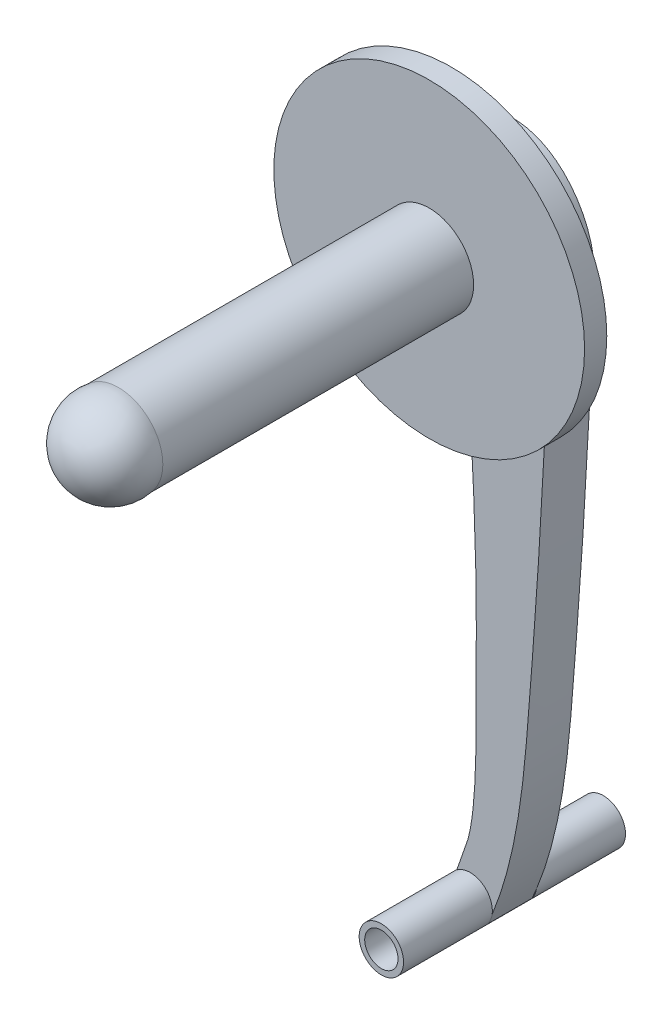
ISO-10303-21;
HEADER;
FILE_DESCRIPTION(('STEP AP214'),'2;1');
FILE_NAME('part.step','',(''),(''),'','','');
FILE_SCHEMA(('AUTOMOTIVE_DESIGN { 1 0 10303 214 1 1 1 1 }'));
ENDSEC;
DATA;
#1=APPLICATION_CONTEXT('core data for automotive mechanical design processes');
#2=APPLICATION_PROTOCOL_DEFINITION('international standard','automotive_design',2000,#1);
#3=PRODUCT_CONTEXT('',#1,'mechanical');
#4=PRODUCT('Part','Part','',(#3));
#5=PRODUCT_RELATED_PRODUCT_CATEGORY('part','',(#4));
#6=PRODUCT_DEFINITION_FORMATION('','',#4);
#7=PRODUCT_DEFINITION_CONTEXT('part definition',#1,'design');
#8=PRODUCT_DEFINITION('design','',#6,#7);
#9=PRODUCT_DEFINITION_SHAPE('','',#8);
#10=(LENGTH_UNIT() NAMED_UNIT(*) SI_UNIT(.MILLI.,.METRE.));
#11=(NAMED_UNIT(*) PLANE_ANGLE_UNIT() SI_UNIT($,.RADIAN.));
#12=(NAMED_UNIT(*) SI_UNIT($,.STERADIAN.) SOLID_ANGLE_UNIT());
#13=UNCERTAINTY_MEASURE_WITH_UNIT(LENGTH_MEASURE(1.E-05),#10,'distance_accuracy_value','');
#14=(GEOMETRIC_REPRESENTATION_CONTEXT(3) GLOBAL_UNCERTAINTY_ASSIGNED_CONTEXT((#13)) GLOBAL_UNIT_ASSIGNED_CONTEXT((#10,
#11,#12)) REPRESENTATION_CONTEXT('',''));
#15=CARTESIAN_POINT('',(0.,0.,0.));
#16=DIRECTION('',(0.,0.,1.));
#17=DIRECTION('',(1.,0.,0.));
#18=AXIS2_PLACEMENT_3D('',#15,#16,#17);
#19=CARTESIAN_POINT('',(2.50663228078687,-1.94869690021748,6.35));
#20=CARTESIAN_POINT('',(6.79184757589289,7.644498001818,6.35));
#21=CARTESIAN_POINT('',(8.23865016719321,25.0555824378428,6.35));
#22=CARTESIAN_POINT('',(10.0949531136006,49.9828909575026,6.35));
#23=CARTESIAN_POINT('',(10.9118015719883,68.4915232685859,6.35));
#24=CARTESIAN_POINT('',(12.4139862903191,85.5621100820569,6.35));
#25=CARTESIAN_POINT('',(5.09918481046593,93.2068392614241,6.35));
#26=CARTESIAN_POINT('',(0.,93.3171933343756,6.35));
#27=B_SPLINE_CURVE_WITH_KNOTS('',3,(#19,#20,#21,#22,#23,#24,#25,#26),.UNSPECIFIED.,.F.,.F.,(4,1,
1,1,1,4),(0.,0.304932513484829,0.511760329482619,0.735953186253162,0.858254476220864,1.),.UNSPECIFIED.);
#28=DIRECTION('',(0.,0.,-1.));
#29=VECTOR('',#28,1.);
#30=SURFACE_OF_LINEAR_EXTRUSION('',#27,#29);
#31=CARTESIAN_POINT('',(2.50663228078687,-1.94869690021748,0.));
#32=CARTESIAN_POINT('',(6.79184757589289,7.644498001818,0.));
#33=CARTESIAN_POINT('',(8.23865016719321,25.0555824378428,0.));
#34=CARTESIAN_POINT('',(10.0949531136006,49.9828909575026,0.));
#35=CARTESIAN_POINT('',(10.9118015719883,68.4915232685859,0.));
#36=CARTESIAN_POINT('',(12.4139862903191,85.5621100820569,0.));
#37=CARTESIAN_POINT('',(5.09918481046593,93.2068392614241,0.));
#38=CARTESIAN_POINT('',(0.,93.3171933343756,0.));
#39=B_SPLINE_CURVE_WITH_KNOTS('',3,(#31,#32,#33,#34,#35,#36,#37,#38),.UNSPECIFIED.,.F.,.F.,(4,1,
1,1,1,4),(0.,0.304932513484829,0.511760329482619,0.735953186253162,0.858254476220864,1.),.UNSPECIFIED.);
#40=CARTESIAN_POINT('',(2.50663228078687,-1.94869690021748,0.));
#41=VERTEX_POINT('',#40);
#42=CARTESIAN_POINT('',(3.14116205546175,-0.462305030609967,0.));
#43=VERTEX_POINT('',#42);
#44=EDGE_CURVE('E113',#41,#43,#39,.T.);
#45=ORIENTED_EDGE('',*,*,#44,.T.);
#46=CARTESIAN_POINT('',(0.,93.3171933343756,0.));
#47=VERTEX_POINT('',#46);
#48=EDGE_CURVE('E120',#43,#47,#39,.T.);
#49=ORIENTED_EDGE('',*,*,#48,.T.);
#50=DIRECTION('',(0.,0.,-1.));
#51=VECTOR('',#50,1.);
#52=CARTESIAN_POINT('',(0.,93.3171933343756,6.35));
#53=LINE('',#52,#51);
#54=CARTESIAN_POINT('',(0.,93.3171933343756,6.35));
#55=VERTEX_POINT('',#54);
#56=EDGE_CURVE('E157',#55,#47,#53,.T.);
#57=ORIENTED_EDGE('',*,*,#56,.F.);
#58=CARTESIAN_POINT('',(3.14116205546175,-0.462305030609967,6.35));
#59=VERTEX_POINT('',#58);
#60=EDGE_CURVE('E100',#59,#55,#27,.T.);
#61=ORIENTED_EDGE('',*,*,#60,.F.);
#62=CARTESIAN_POINT('',(2.50663228078687,-1.94869690021748,6.35));
#63=VERTEX_POINT('',#62);
#64=EDGE_CURVE('E130',#63,#59,#27,.T.);
#65=ORIENTED_EDGE('',*,*,#64,.F.);
#66=DIRECTION('',(0.,0.,-1.));
#67=VECTOR('',#66,1.);
#68=CARTESIAN_POINT('',(2.50663228078687,-1.94869690021748,6.35));
#69=LINE('',#68,#67);
#70=EDGE_CURVE('E125',#63,#41,#69,.T.);
#71=ORIENTED_EDGE('',*,*,#70,.T.);
#72=EDGE_LOOP('',(#45,#49,#57,#61,#65,#71));
#73=FACE_BOUND('',#72,.T.);
#74=ADVANCED_FACE('F43',(#73),#30,.F.);
#75=CARTESIAN_POINT('',(0.,67.6387741491842,6.35));
#76=DIRECTION('',(0.,0.,-1.));
#77=DIRECTION('',(-1.,0.,0.));
#78=AXIS2_PLACEMENT_3D('',#75,#76,#77);
#79=CYLINDRICAL_SURFACE('',#78,25.6784191851915);
#80=CARTESIAN_POINT('',(0.,67.6387741491842,0.));
#81=DIRECTION('',(0.,0.,1.));
#82=DIRECTION('',(1.,0.,0.));
#83=AXIS2_PLACEMENT_3D('',#80,#81,#82);
#84=CIRCLE('',#83,25.6784191851915);
#85=CARTESIAN_POINT('',(-22.4234054714317,80.1516514727327,0.));
#86=VERTEX_POINT('',#85);
#87=EDGE_CURVE('E119',#47,#86,#84,.T.);
#88=ORIENTED_EDGE('',*,*,#87,.T.);
#89=DIRECTION('',(0.,0.,-1.));
#90=VECTOR('',#89,1.);
#91=CARTESIAN_POINT('',(-22.4234054714317,80.1516514727327,6.35));
#92=LINE('',#91,#90);
#93=CARTESIAN_POINT('',(-22.4234054714317,80.1516514727327,6.35));
#94=VERTEX_POINT('',#93);
#95=EDGE_CURVE('E153',#94,#86,#92,.T.);
#96=ORIENTED_EDGE('',*,*,#95,.F.);
#97=CARTESIAN_POINT('',(0.,67.6387741491842,6.35));
#98=DIRECTION('',(0.,0.,1.));
#99=DIRECTION('',(1.,0.,0.));
#100=AXIS2_PLACEMENT_3D('',#97,#98,#99);
#101=CIRCLE('',#100,25.6784191851915);
#102=EDGE_CURVE('E200',#55,#94,#101,.T.);
#103=ORIENTED_EDGE('',*,*,#102,.F.);
#104=ORIENTED_EDGE('',*,*,#56,.T.);
#105=EDGE_LOOP('',(#88,#96,#103,#104));
#106=FACE_BOUND('',#105,.T.);
#107=ADVANCED_FACE('F207',(#106),#79,.T.);
#108=CARTESIAN_POINT('',(-22.4234054714317,80.1516514727327,6.35));
#109=CARTESIAN_POINT('',(-23.0981715014795,78.484949301357,6.35));
#110=CARTESIAN_POINT('',(-21.7101793125884,73.65777514507,6.35));
#111=CARTESIAN_POINT('',(-19.9826645961422,68.7677598488237,6.35));
#112=CARTESIAN_POINT('',(-12.4534255522816,67.1676819119479,6.35));
#113=CARTESIAN_POINT('',(-8.24432583255758,69.3091880074768,6.35));
#114=CARTESIAN_POINT('',(0.0453668571663636,67.6804945172135,6.35));
#115=CARTESIAN_POINT('',(0.404487115203886,52.7492147236427,6.35));
#116=CARTESIAN_POINT('',(0.963776807123551,37.5961578318882,6.35));
#117=CARTESIAN_POINT('',(0.846768385086464,32.3426121330134,6.35));
#118=CARTESIAN_POINT('',(0.858192703651346,19.9211649353462,6.35));
#119=CARTESIAN_POINT('',(0.823670064032925,12.7445285726355,6.35));
#120=CARTESIAN_POINT('',(0.,8.48889990840902,6.35));
#121=B_SPLINE_CURVE_WITH_KNOTS('',3,(#108,#109,#110,#111,#112,#113,#114,#115,#116,#117,#118,
#119,#120),.UNSPECIFIED.,.F.,.F.,(4,1,1,1,1,1,1,1,1,1,4),(0.,0.058727347612114,
0.134625817014667,0.156810161749012,0.266819613488172,0.304169718747484,0.492961109082828,
0.537826004856001,0.707953780706044,0.747032644650169,0.907348672315999),.UNSPECIFIED.);
#122=DIRECTION('',(0.,0.,-1.));
#123=VECTOR('',#122,1.);
#124=SURFACE_OF_LINEAR_EXTRUSION('',#121,#123);
#125=CARTESIAN_POINT('',(-22.4234054714317,80.1516514727327,0.));
#126=CARTESIAN_POINT('',(-23.0981715014795,78.484949301357,0.));
#127=CARTESIAN_POINT('',(-21.7101793125884,73.65777514507,0.));
#128=CARTESIAN_POINT('',(-19.9826645961422,68.7677598488237,0.));
#129=CARTESIAN_POINT('',(-12.4534255522816,67.1676819119479,0.));
#130=CARTESIAN_POINT('',(-8.24432583255758,69.3091880074768,0.));
#131=CARTESIAN_POINT('',(0.0453668571663636,67.6804945172135,0.));
#132=CARTESIAN_POINT('',(0.404487115203886,52.7492147236427,0.));
#133=CARTESIAN_POINT('',(0.963776807123551,37.5961578318882,0.));
#134=CARTESIAN_POINT('',(0.846768385086464,32.3426121330134,0.));
#135=CARTESIAN_POINT('',(0.858192703651346,19.9211649353462,0.));
#136=CARTESIAN_POINT('',(0.823670064032925,12.7445285726355,0.));
#137=CARTESIAN_POINT('',(0.,8.48889990840902,0.));
#138=B_SPLINE_CURVE_WITH_KNOTS('',3,(#125,#126,#127,#128,#129,#130,#131,#132,#133,#134,#135,
#136,#137),.UNSPECIFIED.,.F.,.F.,(4,1,1,1,1,1,1,1,1,1,4),(0.,0.058727347612114,
0.134625817014667,0.156810161749012,0.266819613488172,0.304169718747484,0.492961109082828,
0.537826004856001,0.707953780706044,0.747032644650169,0.907348672315999),.UNSPECIFIED.);
#139=CARTESIAN_POINT('',(0.,8.48889990840902,0.));
#140=VERTEX_POINT('',#139);
#141=EDGE_CURVE('E468',#86,#140,#138,.T.);
#142=ORIENTED_EDGE('',*,*,#141,.T.);
#143=DIRECTION('',(0.,0.,-1.));
#144=VECTOR('',#143,1.);
#145=CARTESIAN_POINT('',(0.,8.48889990840902,6.35));
#146=LINE('',#145,#144);
#147=CARTESIAN_POINT('',(0.,8.48889990840902,6.35));
#148=VERTEX_POINT('',#147);
#149=EDGE_CURVE('E149',#148,#140,#146,.T.);
#150=ORIENTED_EDGE('',*,*,#149,.F.);
#151=EDGE_CURVE('E217',#94,#148,#121,.T.);
#152=ORIENTED_EDGE('',*,*,#151,.F.);
#153=ORIENTED_EDGE('',*,*,#95,.T.);
#154=EDGE_LOOP('',(#142,#150,#152,#153));
#155=FACE_BOUND('',#154,.T.);
#156=ADVANCED_FACE('F210',(#155),#124,.F.);
#157=CARTESIAN_POINT('',(-0.310063399281582,7.13327902007752,6.35));
#158=DIRECTION('',(0.974826131268273,-0.222966396115047,0.));
#159=DIRECTION('',(0.222966396115047,0.974826131268273,0.));
#160=AXIS2_PLACEMENT_3D('',#157,#158,#159);
#161=PLANE('',#160);
#162=DIRECTION('',(-0.222966396115047,-0.974826131268273,0.));
#163=VECTOR('',#162,1.);
#164=CARTESIAN_POINT('',(-0.310063399281582,7.13327902007752,0.));
#165=LINE('',#164,#163);
#166=CARTESIAN_POINT('',(-0.310063399281582,7.13327902007752,0.));
#167=VERTEX_POINT('',#166);
#168=EDGE_CURVE('E463',#140,#167,#165,.T.);
#169=ORIENTED_EDGE('',*,*,#168,.T.);
#170=DIRECTION('',(0.,0.,-1.));
#171=VECTOR('',#170,1.);
#172=CARTESIAN_POINT('',(-0.310063399281582,7.13327902007752,6.35));
#173=LINE('',#172,#171);
#174=CARTESIAN_POINT('',(-0.310063399281582,7.13327902007752,6.35));
#175=VERTEX_POINT('',#174);
#176=EDGE_CURVE('E137',#175,#167,#173,.T.);
#177=ORIENTED_EDGE('',*,*,#176,.F.);
#178=DIRECTION('',(-0.222966396115047,-0.974826131268273,0.));
#179=VECTOR('',#178,1.);
#180=CARTESIAN_POINT('',(-0.310063399281582,7.13327902007752,6.35));
#181=LINE('',#180,#179);
#182=EDGE_CURVE('E70',#148,#175,#181,.T.);
#183=ORIENTED_EDGE('',*,*,#182,.F.);
#184=ORIENTED_EDGE('',*,*,#149,.T.);
#185=EDGE_LOOP('',(#169,#177,#183,#184));
#186=FACE_BOUND('',#185,.T.);
#187=ADVANCED_FACE('F214',(#186),#161,.F.);
#188=CARTESIAN_POINT('',(-0.310063399281582,7.13327902007752,6.35));
#189=CARTESIAN_POINT('',(-1.08234617634393,4.82440788946696,6.35));
#190=CARTESIAN_POINT('',(-1.91151294262382,2.53510222085454,6.35));
#191=B_SPLINE_CURVE_WITH_KNOTS('',2,(#188,#189,#190),.UNSPECIFIED.,.F.,.F.,(3,3),(0.,1.),.UNSPECIFIED.);
#192=DIRECTION('',(0.,0.,-1.));
#193=VECTOR('',#192,1.);
#194=SURFACE_OF_LINEAR_EXTRUSION('',#191,#193);
#195=CARTESIAN_POINT('',(-0.310063399281582,7.13327902007752,0.));
#196=CARTESIAN_POINT('',(-1.08234617634393,4.82440788946696,0.));
#197=CARTESIAN_POINT('',(-1.91151294262382,2.53510222085454,0.));
#198=B_SPLINE_CURVE_WITH_KNOTS('',2,(#195,#196,#197),.UNSPECIFIED.,.F.,.F.,(3,3),(0.,1.),.UNSPECIFIED.);
#199=CARTESIAN_POINT('',(-1.91151294262382,2.53510222085454,0.));
#200=VERTEX_POINT('',#199);
#201=EDGE_CURVE('E141',#167,#200,#198,.T.);
#202=ORIENTED_EDGE('',*,*,#201,.T.);
#203=DIRECTION('',(0.,0.,-1.));
#204=VECTOR('',#203,1.);
#205=CARTESIAN_POINT('',(-1.91151294262382,2.53510222085454,6.35));
#206=LINE('',#205,#204);
#207=CARTESIAN_POINT('',(-1.91151294262382,2.53510222085454,6.35));
#208=VERTEX_POINT('',#207);
#209=EDGE_CURVE('E132',#208,#200,#206,.T.);
#210=ORIENTED_EDGE('',*,*,#209,.F.);
#211=EDGE_CURVE('E133',#175,#208,#191,.T.);
#212=ORIENTED_EDGE('',*,*,#211,.F.);
#213=ORIENTED_EDGE('',*,*,#176,.T.);
#214=EDGE_LOOP('',(#202,#210,#212,#213));
#215=FACE_BOUND('',#214,.T.);
#216=ADVANCED_FACE('F236',(#215),#194,.F.);
#217=CARTESIAN_POINT('',(0.,0.,6.35));
#218=DIRECTION('',(0.,0.,-1.));
#219=DIRECTION('',(-1.,0.,0.));
#220=AXIS2_PLACEMENT_3D('',#217,#218,#219);
#221=CYLINDRICAL_SURFACE('',#220,3.175);
#222=ORIENTED_EDGE('',*,*,#209,.T.);
#223=CARTESIAN_POINT('',(0.,0.,0.));
#224=DIRECTION('',(0.,0.,1.));
#225=DIRECTION('',(1.,0.,0.));
#226=AXIS2_PLACEMENT_3D('',#223,#224,#225);
#227=CIRCLE('',#226,3.175);
#228=EDGE_CURVE('E11',#43,#200,#227,.T.);
#229=ORIENTED_EDGE('',*,*,#228,.F.);
#230=EDGE_CURVE('E54',#41,#43,#227,.T.);
#231=ORIENTED_EDGE('',*,*,#230,.F.);
#232=ORIENTED_EDGE('',*,*,#70,.F.);
#233=CARTESIAN_POINT('',(0.,0.,6.35));
#234=DIRECTION('',(0.,0.,1.));
#235=DIRECTION('',(1.,0.,0.));
#236=AXIS2_PLACEMENT_3D('',#233,#234,#235);
#237=CIRCLE('',#236,3.175);
#238=EDGE_CURVE('E61',#63,#59,#237,.T.);
#239=ORIENTED_EDGE('',*,*,#238,.T.);
#240=CARTESIAN_POINT('',(0.,0.,6.35));
#241=DIRECTION('',(0.,0.,1.));
#242=DIRECTION('',(1.,0.,0.));
#243=AXIS2_PLACEMENT_3D('',#240,#241,#242);
#244=CIRCLE('',#243,3.175);
#245=EDGE_CURVE('E47',#208,#59,#244,.F.);
#246=ORIENTED_EDGE('',*,*,#245,.F.);
#247=EDGE_LOOP('',(#222,#229,#231,#232,#239,#246));
#248=FACE_BOUND('',#247,.T.);
#249=CARTESIAN_POINT('',(0.,0.,19.05));
#250=DIRECTION('',(0.,0.,1.));
#251=DIRECTION('',(1.,0.,0.));
#252=AXIS2_PLACEMENT_3D('',#249,#250,#251);
#253=CIRCLE('',#252,3.175);
#254=CARTESIAN_POINT('',(3.175,0.,19.05));
#255=VERTEX_POINT('',#254);
#256=EDGE_CURVE('E165',#255,#255,#253,.T.);
#257=ORIENTED_EDGE('',*,*,#256,.F.);
#258=EDGE_LOOP('',(#257));
#259=FACE_BOUND('',#258,.T.);
#260=CARTESIAN_POINT('',(0.,0.,-12.7));
#261=DIRECTION('',(0.,0.,1.));
#262=DIRECTION('',(1.,0.,0.));
#263=AXIS2_PLACEMENT_3D('',#260,#261,#262);
#264=CIRCLE('',#263,3.175);
#265=CARTESIAN_POINT('',(3.175,0.,-12.7));
#266=VERTEX_POINT('',#265);
#267=EDGE_CURVE('E128',#266,#266,#264,.T.);
#268=ORIENTED_EDGE('',*,*,#267,.T.);
#269=EDGE_LOOP('',(#268));
#270=FACE_BOUND('',#269,.T.);
#271=ADVANCED_FACE('F123',(#248,#259,#270),#221,.T.);
#272=CARTESIAN_POINT('',(9.87506250008615,48.1646934077021,6.35));
#273=DIRECTION('',(0.,0.,1.));
#274=DIRECTION('',(1.,0.,0.));
#275=AXIS2_PLACEMENT_3D('',#272,#273,#274);
#276=PLANE('',#275);
#277=CARTESIAN_POINT('',(0.494989456055996,82.55,6.35));
#278=DIRECTION('',(0.,0.,1.));
#279=DIRECTION('',(1.,0.,0.));
#280=AXIS2_PLACEMENT_3D('',#277,#278,#279);
#281=CIRCLE('',#280,9.52499999999998);
#282=CARTESIAN_POINT('',(10.019989456056,82.55,6.35));
#283=VERTEX_POINT('',#282);
#284=EDGE_CURVE('E186',#283,#283,#281,.T.);
#285=ORIENTED_EDGE('',*,*,#284,.F.);
#286=EDGE_LOOP('',(#285));
#287=FACE_BOUND('',#286,.T.);
#288=ORIENTED_EDGE('',*,*,#211,.T.);
#289=ORIENTED_EDGE('',*,*,#245,.T.);
#290=ORIENTED_EDGE('',*,*,#60,.T.);
#291=ORIENTED_EDGE('',*,*,#102,.T.);
#292=ORIENTED_EDGE('',*,*,#151,.T.);
#293=ORIENTED_EDGE('',*,*,#182,.T.);
#294=EDGE_LOOP('',(#288,#289,#290,#291,#292,#293));
#295=FACE_BOUND('',#294,.T.);
#296=ADVANCED_FACE('F242',(#287,#295),#276,.T.);
#297=CARTESIAN_POINT('',(9.87506250008615,48.1646934077021,0.));
#298=DIRECTION('',(0.,0.,1.));
#299=DIRECTION('',(1.,0.,0.));
#300=AXIS2_PLACEMENT_3D('',#297,#298,#299);
#301=PLANE('',#300);
#302=ORIENTED_EDGE('',*,*,#48,.F.);
#303=ORIENTED_EDGE('',*,*,#228,.T.);
#304=ORIENTED_EDGE('',*,*,#201,.F.);
#305=ORIENTED_EDGE('',*,*,#168,.F.);
#306=ORIENTED_EDGE('',*,*,#141,.F.);
#307=ORIENTED_EDGE('',*,*,#87,.F.);
#308=EDGE_LOOP('',(#302,#303,#304,#305,#306,#307));
#309=FACE_BOUND('',#308,.T.);
#310=ADVANCED_FACE('F243',(#309),#301,.F.);
#311=CARTESIAN_POINT('',(0.494989456055996,82.55,9.525));
#312=DIRECTION('',(0.,0.,-1.));
#313=DIRECTION('',(-1.,0.,0.));
#314=AXIS2_PLACEMENT_3D('',#311,#312,#313);
#315=CYLINDRICAL_SURFACE('',#314,9.52499999999998);
#316=CARTESIAN_POINT('',(0.494989456055996,82.55,9.525));
#317=DIRECTION('',(0.,0.,1.));
#318=DIRECTION('',(1.,0.,0.));
#319=AXIS2_PLACEMENT_3D('',#316,#317,#318);
#320=CIRCLE('',#319,9.52499999999998);
#321=CARTESIAN_POINT('',(10.019989456056,82.55,9.525));
#322=VERTEX_POINT('',#321);
#323=EDGE_CURVE('E188',#322,#322,#320,.T.);
#324=ORIENTED_EDGE('',*,*,#323,.F.);
#325=EDGE_LOOP('',(#324));
#326=FACE_BOUND('',#325,.T.);
#327=ORIENTED_EDGE('',*,*,#284,.T.);
#328=EDGE_LOOP('',(#327));
#329=FACE_BOUND('',#328,.T.);
#330=ADVANCED_FACE('F246',(#326,#329),#315,.T.);
#331=CARTESIAN_POINT('',(0.494989456055996,82.55,12.7));
#332=DIRECTION('',(0.,0.,-1.));
#333=DIRECTION('',(-1.,0.,0.));
#334=AXIS2_PLACEMENT_3D('',#331,#332,#333);
#335=CYLINDRICAL_SURFACE('',#334,22.225);
#336=CARTESIAN_POINT('',(0.494989456055996,82.55,12.7));
#337=DIRECTION('',(0.,0.,1.));
#338=DIRECTION('',(1.,0.,0.));
#339=AXIS2_PLACEMENT_3D('',#336,#337,#338);
#340=CIRCLE('',#339,22.225);
#341=CARTESIAN_POINT('',(22.719989456056,82.55,12.7));
#342=VERTEX_POINT('',#341);
#343=EDGE_CURVE('E171',#342,#342,#340,.T.);
#344=ORIENTED_EDGE('',*,*,#343,.F.);
#345=EDGE_LOOP('',(#344));
#346=FACE_BOUND('',#345,.T.);
#347=CARTESIAN_POINT('',(0.494989456055996,82.55,9.525));
#348=DIRECTION('',(0.,0.,1.));
#349=DIRECTION('',(1.,0.,0.));
#350=AXIS2_PLACEMENT_3D('',#347,#348,#349);
#351=CIRCLE('',#350,22.225);
#352=CARTESIAN_POINT('',(22.719989456056,82.55,9.525));
#353=VERTEX_POINT('',#352);
#354=EDGE_CURVE('E164',#353,#353,#351,.T.);
#355=ORIENTED_EDGE('',*,*,#354,.T.);
#356=EDGE_LOOP('',(#355));
#357=FACE_BOUND('',#356,.T.);
#358=ADVANCED_FACE('F252',(#346,#357),#335,.T.);
#359=CARTESIAN_POINT('',(0.494989456055996,82.55,12.7));
#360=DIRECTION('',(0.,0.,1.));
#361=DIRECTION('',(1.,0.,0.));
#362=AXIS2_PLACEMENT_3D('',#359,#360,#361);
#363=PLANE('',#362);
#364=CARTESIAN_POINT('',(0.494989456055996,82.55,12.7));
#365=DIRECTION('',(0.,0.,1.));
#366=DIRECTION('',(1.,0.,0.));
#367=AXIS2_PLACEMENT_3D('',#364,#365,#366);
#368=CIRCLE('',#367,6.35);
#369=CARTESIAN_POINT('',(6.84498945605599,82.55,12.7));
#370=VERTEX_POINT('',#369);
#371=EDGE_CURVE('E160',#370,#370,#368,.T.);
#372=ORIENTED_EDGE('',*,*,#371,.F.);
#373=EDGE_LOOP('',(#372));
#374=FACE_BOUND('',#373,.T.);
#375=ORIENTED_EDGE('',*,*,#343,.T.);
#376=EDGE_LOOP('',(#375));
#377=FACE_BOUND('',#376,.T.);
#378=ADVANCED_FACE('F256',(#374,#377),#363,.T.);
#379=CARTESIAN_POINT('',(0.494989456055996,82.55,9.525));
#380=DIRECTION('',(0.,0.,1.));
#381=DIRECTION('',(1.,0.,0.));
#382=AXIS2_PLACEMENT_3D('',#379,#380,#381);
#383=PLANE('',#382);
#384=ORIENTED_EDGE('',*,*,#323,.T.);
#385=EDGE_LOOP('',(#384));
#386=FACE_BOUND('',#385,.T.);
#387=ORIENTED_EDGE('',*,*,#354,.F.);
#388=EDGE_LOOP('',(#387));
#389=FACE_BOUND('',#388,.T.);
#390=ADVANCED_FACE('F258',(#386,#389),#383,.F.);
#391=CARTESIAN_POINT('',(0.494989456055996,82.55,57.15));
#392=DIRECTION('',(0.,0.,-1.));
#393=DIRECTION('',(-1.,0.,0.));
#394=AXIS2_PLACEMENT_3D('',#391,#392,#393);
#395=CYLINDRICAL_SURFACE('',#394,6.35);
#396=CARTESIAN_POINT('',(0.494989456055996,82.55,57.15));
#397=DIRECTION('',(0.,0.,1.));
#398=DIRECTION('',(1.,0.,0.));
#399=AXIS2_PLACEMENT_3D('',#396,#397,#398);
#400=CIRCLE('',#399,6.35);
#401=CARTESIAN_POINT('',(6.84498945605599,82.55,57.15));
#402=VERTEX_POINT('',#401);
#403=EDGE_CURVE('E161',#402,#402,#400,.T.);
#404=ORIENTED_EDGE('',*,*,#403,.F.);
#405=EDGE_LOOP('',(#404));
#406=FACE_BOUND('',#405,.T.);
#407=ORIENTED_EDGE('',*,*,#371,.T.);
#408=EDGE_LOOP('',(#407));
#409=FACE_BOUND('',#408,.T.);
#410=ADVANCED_FACE('F261',(#406,#409),#395,.T.);
#411=CARTESIAN_POINT('',(0.494989456055996,82.55,58.3141666666667));
#412=DIRECTION('',(0.,0.,1.));
#413=DIRECTION('',(1.,0.,0.));
#414=AXIS2_PLACEMENT_3D('',#411,#412,#413);
#415=SPHERICAL_SURFACE('',#414,6.45583333333333);
#416=ORIENTED_EDGE('',*,*,#403,.T.);
#417=EDGE_LOOP('',(#416));
#418=FACE_BOUND('',#417,.T.);
#419=ADVANCED_FACE('F45',(#418),#415,.T.);
#420=CARTESIAN_POINT('',(0.,0.,6.35));
#421=DIRECTION('',(0.,0.,1.));
#422=DIRECTION('',(1.,0.,0.));
#423=AXIS2_PLACEMENT_3D('',#420,#421,#422);
#424=PLANE('',#423);
#425=ORIENTED_EDGE('',*,*,#238,.F.);
#426=ORIENTED_EDGE('',*,*,#64,.T.);
#427=EDGE_LOOP('',(#425,#426));
#428=FACE_BOUND('',#427,.T.);
#429=ADVANCED_FACE('F269',(#428),#424,.F.);
#430=CARTESIAN_POINT('',(0.,0.,19.05));
#431=DIRECTION('',(0.,0.,1.));
#432=DIRECTION('',(1.,0.,0.));
#433=AXIS2_PLACEMENT_3D('',#430,#431,#432);
#434=PLANE('',#433);
#435=CARTESIAN_POINT('',(0.,0.,19.05));
#436=DIRECTION('',(0.,0.,1.));
#437=DIRECTION('',(1.,0.,0.));
#438=AXIS2_PLACEMENT_3D('',#435,#436,#437);
#439=CIRCLE('',#438,2.38125);
#440=CARTESIAN_POINT('',(2.38125,0.,19.05));
#441=VERTEX_POINT('',#440);
#442=EDGE_CURVE('E293',#441,#441,#439,.T.);
#443=ORIENTED_EDGE('',*,*,#442,.F.);
#444=EDGE_LOOP('',(#443));
#445=FACE_BOUND('',#444,.T.);
#446=ORIENTED_EDGE('',*,*,#256,.T.);
#447=EDGE_LOOP('',(#446));
#448=FACE_BOUND('',#447,.T.);
#449=ADVANCED_FACE('F272',(#445,#448),#434,.T.);
#450=CARTESIAN_POINT('',(0.,0.,-12.7));
#451=DIRECTION('',(0.,0.,-1.));
#452=DIRECTION('',(1.,0.,0.));
#453=AXIS2_PLACEMENT_3D('',#450,#451,#452);
#454=PLANE('',#453);
#455=CARTESIAN_POINT('',(0.,0.,-12.7));
#456=DIRECTION('',(0.,0.,1.));
#457=DIRECTION('',(1.,0.,0.));
#458=AXIS2_PLACEMENT_3D('',#455,#456,#457);
#459=CIRCLE('',#458,2.38125);
#460=CARTESIAN_POINT('',(2.38125,0.,-12.7));
#461=VERTEX_POINT('',#460);
#462=EDGE_CURVE('E129',#461,#461,#459,.T.);
#463=ORIENTED_EDGE('',*,*,#462,.T.);
#464=EDGE_LOOP('',(#463));
#465=FACE_BOUND('',#464,.T.);
#466=ORIENTED_EDGE('',*,*,#267,.F.);
#467=EDGE_LOOP('',(#466));
#468=FACE_BOUND('',#467,.T.);
#469=ADVANCED_FACE('F276',(#465,#468),#454,.T.);
#470=CARTESIAN_POINT('',(0.,0.,0.));
#471=DIRECTION('',(0.,0.,-1.));
#472=DIRECTION('',(1.,0.,0.));
#473=AXIS2_PLACEMENT_3D('',#470,#471,#472);
#474=PLANE('',#473);
#475=ORIENTED_EDGE('',*,*,#44,.F.);
#476=ORIENTED_EDGE('',*,*,#230,.T.);
#477=EDGE_LOOP('',(#475,#476));
#478=FACE_BOUND('',#477,.T.);
#479=ADVANCED_FACE('F115',(#478),#474,.F.);
#480=CARTESIAN_POINT('',(0.,0.,-12.7));
#481=DIRECTION('',(0.,0.,1.));
#482=DIRECTION('',(1.,0.,0.));
#483=AXIS2_PLACEMENT_3D('',#480,#481,#482);
#484=CYLINDRICAL_SURFACE('',#483,2.38125);
#485=ORIENTED_EDGE('',*,*,#462,.F.);
#486=EDGE_LOOP('',(#485));
#487=FACE_BOUND('',#486,.T.);
#488=ORIENTED_EDGE('',*,*,#442,.T.);
#489=EDGE_LOOP('',(#488));
#490=FACE_BOUND('',#489,.T.);
#491=ADVANCED_FACE('F280',(#487,#490),#484,.F.);
#492=CLOSED_SHELL('',(#74,#107,#156,#187,#216,#271,#296,#310,#330,#358,#378,#390,#410,#419,#429,
#449,#469,#479,#491));
#493=MANIFOLD_SOLID_BREP('B2',#492);
#494=ADVANCED_BREP_SHAPE_REPRESENTATION('',(#18,#493),#14);
#495=SHAPE_DEFINITION_REPRESENTATION(#9,#494);
ENDSEC;
END-ISO-10303-21;
